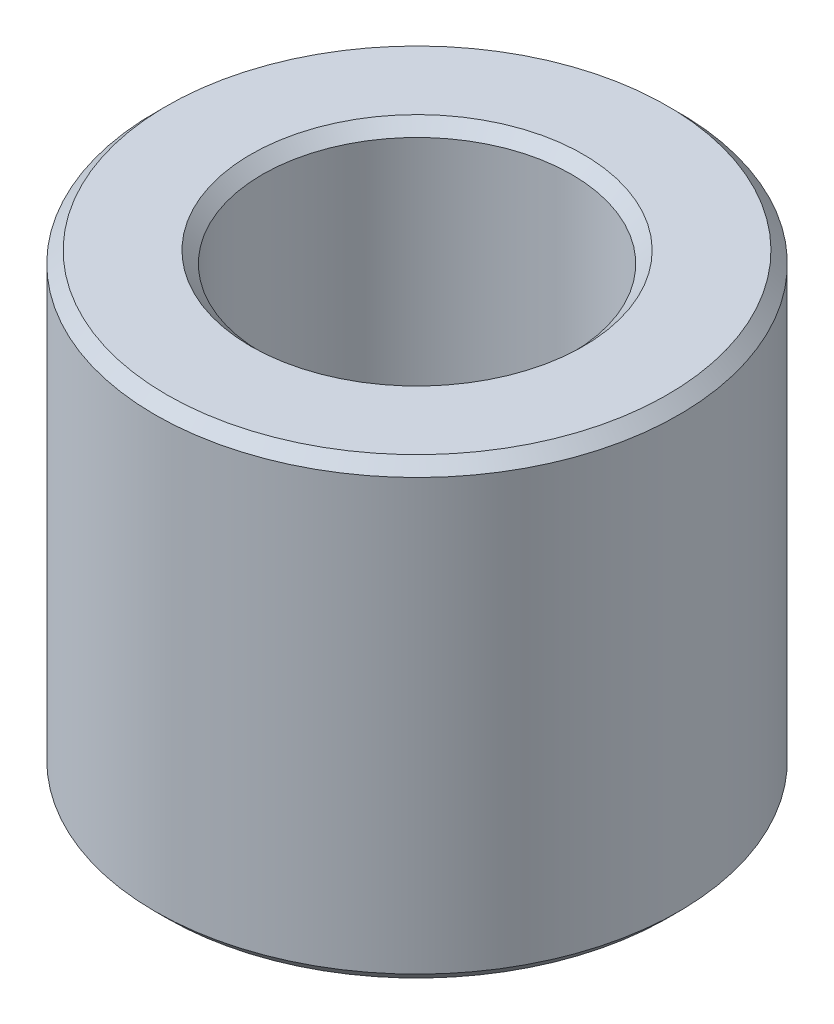
ISO-10303-21;
HEADER;
FILE_DESCRIPTION(('STEP AP214'),'2;1');
FILE_NAME('part.step','',(''),(''),'','','');
FILE_SCHEMA(('AUTOMOTIVE_DESIGN { 1 0 10303 214 1 1 1 1 }'));
ENDSEC;
DATA;
#1=APPLICATION_CONTEXT('core data for automotive mechanical design processes');
#2=APPLICATION_PROTOCOL_DEFINITION('international standard','automotive_design',2000,#1);
#3=PRODUCT_CONTEXT('',#1,'mechanical');
#4=PRODUCT('Part','Part','',(#3));
#5=PRODUCT_RELATED_PRODUCT_CATEGORY('part','',(#4));
#6=PRODUCT_DEFINITION_FORMATION('','',#4);
#7=PRODUCT_DEFINITION_CONTEXT('part definition',#1,'design');
#8=PRODUCT_DEFINITION('design','',#6,#7);
#9=PRODUCT_DEFINITION_SHAPE('','',#8);
#10=(LENGTH_UNIT() NAMED_UNIT(*) SI_UNIT(.MILLI.,.METRE.));
#11=(NAMED_UNIT(*) PLANE_ANGLE_UNIT() SI_UNIT($,.RADIAN.));
#12=(NAMED_UNIT(*) SI_UNIT($,.STERADIAN.) SOLID_ANGLE_UNIT());
#13=UNCERTAINTY_MEASURE_WITH_UNIT(LENGTH_MEASURE(1.E-05),#10,'distance_accuracy_value','');
#14=(GEOMETRIC_REPRESENTATION_CONTEXT(3) GLOBAL_UNCERTAINTY_ASSIGNED_CONTEXT((#13)) GLOBAL_UNIT_ASSIGNED_CONTEXT((#10,
#11,#12)) REPRESENTATION_CONTEXT('',''));
#15=CARTESIAN_POINT('',(0.,0.,0.));
#16=DIRECTION('',(0.,0.,1.));
#17=DIRECTION('',(1.,0.,0.));
#18=AXIS2_PLACEMENT_3D('',#15,#16,#17);
#19=CARTESIAN_POINT('',(0.,56.2595260498912,0.));
#20=DIRECTION('',(0.,-1.,0.));
#21=DIRECTION('',(0.,0.,-1.));
#22=AXIS2_PLACEMENT_3D('',#19,#20,#21);
#23=CYLINDRICAL_SURFACE('',#22,32.5);
#24=CARTESIAN_POINT('',(0.,1.43956234466632,0.));
#25=DIRECTION('',(0.,1.,0.));
#26=DIRECTION('',(0.,0.,1.));
#27=AXIS2_PLACEMENT_3D('',#24,#25,#26);
#28=CIRCLE('',#27,32.5);
#29=CARTESIAN_POINT('',(0.,1.43956234466632,32.5));
#30=VERTEX_POINT('',#29);
#31=EDGE_CURVE('E10',#30,#30,#28,.T.);
#32=ORIENTED_EDGE('',*,*,#31,.T.);
#33=EDGE_LOOP('',(#32));
#34=FACE_BOUND('',#33,.T.);
#35=CARTESIAN_POINT('',(0.,54.8199637052249,0.));
#36=DIRECTION('',(0.,1.,0.));
#37=DIRECTION('',(0.,0.,1.));
#38=AXIS2_PLACEMENT_3D('',#35,#36,#37);
#39=CIRCLE('',#38,32.5);
#40=CARTESIAN_POINT('',(0.,54.8199637052249,32.5));
#41=VERTEX_POINT('',#40);
#42=EDGE_CURVE('E50',#41,#41,#39,.F.);
#43=ORIENTED_EDGE('',*,*,#42,.T.);
#44=EDGE_LOOP('',(#43));
#45=FACE_BOUND('',#44,.T.);
#46=ADVANCED_FACE('F39',(#34,#45),#23,.T.);
#47=CARTESIAN_POINT('',(0.,56.2595260498912,0.));
#48=DIRECTION('',(0.,1.,0.));
#49=DIRECTION('',(0.,0.,1.));
#50=AXIS2_PLACEMENT_3D('',#47,#48,#49);
#51=PLANE('',#50);
#52=CARTESIAN_POINT('',(0.,56.2595260498912,0.));
#53=DIRECTION('',(0.,1.,0.));
#54=DIRECTION('',(0.,0.,1.));
#55=AXIS2_PLACEMENT_3D('',#52,#53,#54);
#56=CIRCLE('',#55,20.6347470521477);
#57=CARTESIAN_POINT('',(0.,56.2595260498912,20.6347470521477));
#58=VERTEX_POINT('',#57);
#59=EDGE_CURVE('E58',#58,#58,#56,.F.);
#60=ORIENTED_EDGE('',*,*,#59,.T.);
#61=EDGE_LOOP('',(#60));
#62=FACE_BOUND('',#61,.T.);
#63=CARTESIAN_POINT('',(0.,56.2595260498912,0.));
#64=DIRECTION('',(0.,1.,0.));
#65=DIRECTION('',(0.,0.,1.));
#66=AXIS2_PLACEMENT_3D('',#63,#64,#65);
#67=CIRCLE('',#66,31.0604376553336);
#68=CARTESIAN_POINT('',(0.,56.2595260498912,31.0604376553336));
#69=VERTEX_POINT('',#68);
#70=EDGE_CURVE('E61',#69,#69,#67,.T.);
#71=ORIENTED_EDGE('',*,*,#70,.T.);
#72=EDGE_LOOP('',(#71));
#73=FACE_BOUND('',#72,.T.);
#74=ADVANCED_FACE('F88',(#62,#73),#51,.T.);
#75=CARTESIAN_POINT('',(0.,0.,0.));
#76=DIRECTION('',(0.,1.,0.));
#77=DIRECTION('',(0.,0.,1.));
#78=AXIS2_PLACEMENT_3D('',#75,#76,#77);
#79=PLANE('',#78);
#80=CARTESIAN_POINT('',(0.,0.,0.));
#81=DIRECTION('',(0.,1.,0.));
#82=DIRECTION('',(0.,0.,1.));
#83=AXIS2_PLACEMENT_3D('',#80,#81,#82);
#84=CIRCLE('',#83,20.6347470521477);
#85=CARTESIAN_POINT('',(0.,0.,-20.6347470521477));
#86=VERTEX_POINT('',#85);
#87=EDGE_CURVE('E51',#86,#86,#84,.T.);
#88=ORIENTED_EDGE('',*,*,#87,.T.);
#89=EDGE_LOOP('',(#88));
#90=FACE_BOUND('',#89,.T.);
#91=CARTESIAN_POINT('',(0.,0.,0.));
#92=DIRECTION('',(0.,1.,0.));
#93=DIRECTION('',(0.,0.,1.));
#94=AXIS2_PLACEMENT_3D('',#91,#92,#93);
#95=CIRCLE('',#94,31.0604376553337);
#96=CARTESIAN_POINT('',(0.,0.,31.0604376553337));
#97=VERTEX_POINT('',#96);
#98=EDGE_CURVE('E54',#97,#97,#95,.F.);
#99=ORIENTED_EDGE('',*,*,#98,.T.);
#100=EDGE_LOOP('',(#99));
#101=FACE_BOUND('',#100,.T.);
#102=ADVANCED_FACE('F83',(#90,#101),#79,.F.);
#103=CARTESIAN_POINT('',(0.,56.2595260498912,0.));
#104=DIRECTION('',(0.,-1.,0.));
#105=DIRECTION('',(0.,0.,-1.));
#106=AXIS2_PLACEMENT_3D('',#103,#104,#105);
#107=CYLINDRICAL_SURFACE('',#106,19.1951847074814);
#108=CARTESIAN_POINT('',(0.,54.8199637052249,0.));
#109=DIRECTION('',(0.,1.,0.));
#110=DIRECTION('',(0.,0.,1.));
#111=AXIS2_PLACEMENT_3D('',#108,#109,#110);
#112=CIRCLE('',#111,19.1951847074814);
#113=CARTESIAN_POINT('',(0.,54.8199637052249,-19.1951847074814));
#114=VERTEX_POINT('',#113);
#115=EDGE_CURVE('E67',#114,#114,#112,.T.);
#116=CARTESIAN_POINT('',(0.,1.43956234466635,0.));
#117=DIRECTION('',(0.,1.,0.));
#118=DIRECTION('',(0.,0.,1.));
#119=AXIS2_PLACEMENT_3D('',#116,#117,#118);
#120=CIRCLE('',#119,19.1951847074814);
#121=CARTESIAN_POINT('',(0.,1.43956234466634,-19.1951847074814));
#122=VERTEX_POINT('',#121);
#123=EDGE_CURVE('E69',#122,#122,#120,.F.);
#124=CARTESIAN_POINT('',(0.,54.8199637052249,-19.1951847074814));
#125=CARTESIAN_POINT('',(0.,54.2639178577191,-19.1951847074814));
#126=CARTESIAN_POINT('',(0.,53.7078720102133,-19.1951847074814));
#127=CARTESIAN_POINT('',(0.,52.5957803152016,-19.1951847074814));
#128=CARTESIAN_POINT('',(0.,52.0397344676958,-19.1951847074814));
#129=CARTESIAN_POINT('',(0.,50.9276427726842,-19.1951847074814));
#130=CARTESIAN_POINT('',(0.,50.3715969251784,-19.1951847074814));
#131=CARTESIAN_POINT('',(0.,49.2595052301667,-19.1951847074814));
#132=CARTESIAN_POINT('',(0.,48.7034593826609,-19.1951847074814));
#133=CARTESIAN_POINT('',(0.,47.5913676876493,-19.1951847074814));
#134=CARTESIAN_POINT('',(0.,47.0353218401435,-19.1951847074814));
#135=CARTESIAN_POINT('',(0.,45.9232301451318,-19.1951847074814));
#136=CARTESIAN_POINT('',(0.,45.367184297626,-19.1951847074814));
#137=CARTESIAN_POINT('',(0.,44.2550926026144,-19.1951847074814));
#138=CARTESIAN_POINT('',(0.,43.6990467551085,-19.1951847074814));
#139=CARTESIAN_POINT('',(0.,42.5869550600969,-19.1951847074814));
#140=CARTESIAN_POINT('',(0.,42.0309092125911,-19.1951847074814));
#141=CARTESIAN_POINT('',(0.,40.9188175175794,-19.1951847074814));
#142=CARTESIAN_POINT('',(0.,40.3627716700736,-19.1951847074814));
#143=CARTESIAN_POINT('',(0.,39.250679975062,-19.1951847074814));
#144=CARTESIAN_POINT('',(0.,38.6946341275562,-19.1951847074814));
#145=CARTESIAN_POINT('',(0.,37.5825424325445,-19.1951847074814));
#146=CARTESIAN_POINT('',(0.,37.0264965850387,-19.1951847074814));
#147=CARTESIAN_POINT('',(0.,35.9144048900271,-19.1951847074814));
#148=CARTESIAN_POINT('',(0.,35.3583590425213,-19.1951847074814));
#149=CARTESIAN_POINT('',(0.,34.2462673475096,-19.1951847074814));
#150=CARTESIAN_POINT('',(0.,33.6902215000038,-19.1951847074814));
#151=CARTESIAN_POINT('',(0.,32.5781298049922,-19.1951847074814));
#152=CARTESIAN_POINT('',(0.,32.0220839574864,-19.1951847074814));
#153=CARTESIAN_POINT('',(0.,30.9099922624747,-19.1951847074814));
#154=CARTESIAN_POINT('',(0.,30.3539464149689,-19.1951847074814));
#155=CARTESIAN_POINT('',(0.,29.2418547199573,-19.1951847074814));
#156=CARTESIAN_POINT('',(0.,28.6858088724514,-19.1951847074814));
#157=CARTESIAN_POINT('',(0.,27.5737171774398,-19.1951847074814));
#158=CARTESIAN_POINT('',(0.,27.017671329934,-19.1951847074814));
#159=CARTESIAN_POINT('',(0.,25.9055796349224,-19.1951847074814));
#160=CARTESIAN_POINT('',(0.,25.3495337874165,-19.1951847074814));
#161=CARTESIAN_POINT('',(0.,24.2374420924049,-19.1951847074814));
#162=CARTESIAN_POINT('',(0.,23.6813962448991,-19.1951847074814));
#163=CARTESIAN_POINT('',(0.,22.5693045498874,-19.1951847074814));
#164=CARTESIAN_POINT('',(0.,22.0132587023816,-19.1951847074814));
#165=CARTESIAN_POINT('',(0.,20.90116700737,-19.1951847074814));
#166=CARTESIAN_POINT('',(0.,20.3451211598642,-19.1951847074814));
#167=CARTESIAN_POINT('',(0.,19.2330294648525,-19.1951847074814));
#168=CARTESIAN_POINT('',(0.,18.6769836173467,-19.1951847074814));
#169=CARTESIAN_POINT('',(0.,17.5648919223351,-19.1951847074814));
#170=CARTESIAN_POINT('',(0.,17.0088460748293,-19.1951847074814));
#171=CARTESIAN_POINT('',(0.,15.8967543798176,-19.1951847074814));
#172=CARTESIAN_POINT('',(0.,15.3407085323118,-19.1951847074814));
#173=CARTESIAN_POINT('',(0.,14.2286168373002,-19.1951847074814));
#174=CARTESIAN_POINT('',(0.,13.6725709897943,-19.1951847074814));
#175=CARTESIAN_POINT('',(0.,12.5604792947827,-19.1951847074814));
#176=CARTESIAN_POINT('',(0.,12.0044334472769,-19.1951847074814));
#177=CARTESIAN_POINT('',(0.,10.8923417522653,-19.1951847074814));
#178=CARTESIAN_POINT('',(0.,10.3362959047594,-19.1951847074814));
#179=CARTESIAN_POINT('',(0.,9.2242042097478,-19.1951847074814));
#180=CARTESIAN_POINT('',(0.,8.66815836224198,-19.1951847074814));
#181=CARTESIAN_POINT('',(0.,7.55606666723035,-19.1951847074814));
#182=CARTESIAN_POINT('',(0.,7.00002081972453,-19.1951847074814));
#183=CARTESIAN_POINT('',(0.,5.88792912471289,-19.1951847074814));
#184=CARTESIAN_POINT('',(0.,5.33188327720707,-19.1951847074814));
#185=CARTESIAN_POINT('',(0.,4.21979158219544,-19.1951847074814));
#186=CARTESIAN_POINT('',(0.,3.66374573468962,-19.1951847074814));
#187=CARTESIAN_POINT('',(0.,2.55165403967798,-19.1951847074814));
#188=CARTESIAN_POINT('',(0.,1.99560819217216,-19.1951847074814));
#189=CARTESIAN_POINT('',(0.,1.43956234466634,-19.1951847074814));
#190=B_SPLINE_CURVE_WITH_KNOTS('',3,(#124,#125,#126,#127,#128,#129,#130,#131,#132,#133,#134,
#135,#136,#137,#138,#139,#140,#141,#142,#143,#144,#145,#146,#147,#148,#149,#150,#151,#152,#153,
#154,#155,#156,#157,#158,#159,#160,#161,#162,#163,#164,#165,#166,#167,#168,#169,#170,#171,#172,
#173,#174,#175,#176,#177,#178,#179,#180,#181,#182,#183,#184,#185,#186,#187,#188,#189),
.UNSPECIFIED.,.F.,.F.,(4,2,2,2,2,2,2,2,2,2,2,2,2,2,2,2,2,2,2,2,2,2,2,2,2,2,2,2,2,2,2,2,4),(0.,
1.66813754251745,3.33627508503491,5.00441262755236,6.67255017006982,8.34068771258727,
10.0088252551047,11.6769627976222,13.3451003401396,15.0132378826571,16.6813754251745,
18.349512967692,20.0176505102095,21.6857880527269,23.3539255952444,25.0220631377618,
26.6902006802793,28.3583382227967,30.0264757653142,31.6946133078316,33.3627508503491,
35.0308883928666,36.699025935384,38.3671634779015,40.0353010204189,41.7034385629364,
43.3715761054538,45.0397136479713,46.7078511904887,48.3759887330062,50.0441262755237,
51.7122638180411,53.3804013605586),.UNSPECIFIED.);
#191=EDGE_CURVE('BSEAM71',#114,#122,#190,.T.);
#192=ORIENTED_EDGE('',*,*,#115,.T.);
#193=ORIENTED_EDGE('',*,*,#123,.T.);
#194=ORIENTED_EDGE('',*,*,#191,.T.);
#195=ORIENTED_EDGE('',*,*,#191,.F.);
#196=EDGE_LOOP('',(#192,#194,#193,#195));
#197=FACE_BOUND('',#196,.T.);
#198=ADVANCED_FACE('F71',(#197),#107,.F.);
#199=CARTESIAN_POINT('',(0.,54.8199637052249,0.));
#200=DIRECTION('',(0.,1.,0.));
#201=DIRECTION('',(0.,0.,1.));
#202=AXIS2_PLACEMENT_3D('',#199,#200,#201);
#203=CONICAL_SURFACE('',#202,19.1951847074814,0.785398163397454);
#204=ORIENTED_EDGE('',*,*,#59,.F.);
#205=EDGE_LOOP('',(#204));
#206=FACE_BOUND('',#205,.T.);
#207=ORIENTED_EDGE('',*,*,#115,.F.);
#208=EDGE_LOOP('',(#207));
#209=FACE_BOUND('',#208,.T.);
#210=ADVANCED_FACE('F77',(#206,#209),#203,.F.);
#211=CARTESIAN_POINT('',(0.,0.,0.));
#212=DIRECTION('',(0.,-1.,0.));
#213=DIRECTION('',(0.,0.,-1.));
#214=AXIS2_PLACEMENT_3D('',#211,#212,#213);
#215=CONICAL_SURFACE('',#214,20.6347470521477,0.785398163397447);
#216=CARTESIAN_POINT('',(0.,1.43956234466635,-19.1951847074814));
#217=CARTESIAN_POINT('',(0.,1.42456690357607,-19.2101801485716));
#218=CARTESIAN_POINT('',(0.,1.4095714624858,-19.2251755896619));
#219=CARTESIAN_POINT('',(0.,1.37958058030525,-19.2551664718425));
#220=CARTESIAN_POINT('',(0.,1.36458513921498,-19.2701619129327));
#221=CARTESIAN_POINT('',(0.,1.33459425703443,-19.3001527951133));
#222=CARTESIAN_POINT('',(0.,1.31959881594415,-19.3151482362036));
#223=CARTESIAN_POINT('',(0.,1.2896079337636,-19.3451391183841));
#224=CARTESIAN_POINT('',(0.,1.27461249267333,-19.3601345594744));
#225=CARTESIAN_POINT('',(0.,1.24462161049278,-19.3901254416549));
#226=CARTESIAN_POINT('',(0.,1.22962616940251,-19.4051208827452));
#227=CARTESIAN_POINT('',(0.,1.19963528722196,-19.4351117649258));
#228=CARTESIAN_POINT('',(0.,1.18463984613168,-19.450107206016));
#229=CARTESIAN_POINT('',(0.,1.15464896395113,-19.4800980881966));
#230=CARTESIAN_POINT('',(0.,1.13965352286086,-19.4950935292868));
#231=CARTESIAN_POINT('',(0.,1.10966264068031,-19.5250844114674));
#232=CARTESIAN_POINT('',(0.,1.09466719959004,-19.5400798525577));
#233=CARTESIAN_POINT('',(0.,1.06467631740949,-19.5700707347382));
#234=CARTESIAN_POINT('',(0.,1.04968087631921,-19.5850661758285));
#235=CARTESIAN_POINT('',(0.,1.01968999413866,-19.615057058009));
#236=CARTESIAN_POINT('',(0.,1.00469455304839,-19.6300524990993));
#237=CARTESIAN_POINT('',(0.,0.974703670867841,-19.6600433812799));
#238=CARTESIAN_POINT('',(0.,0.959708229777566,-19.6750388223701));
#239=CARTESIAN_POINT('',(0.,0.929717347597017,-19.7050297045507));
#240=CARTESIAN_POINT('',(0.,0.914721906506743,-19.720025145641));
#241=CARTESIAN_POINT('',(0.,0.884731024326194,-19.7500160278215));
#242=CARTESIAN_POINT('',(0.,0.869735583235919,-19.7650114689118));
#243=CARTESIAN_POINT('',(0.,0.83974470105537,-19.7950023510923));
#244=CARTESIAN_POINT('',(0.,0.824749259965096,-19.8099977921826));
#245=CARTESIAN_POINT('',(0.,0.794758377784547,-19.8399886743632));
#246=CARTESIAN_POINT('',(0.,0.779762936694273,-19.8549841154534));
#247=CARTESIAN_POINT('',(0.,0.749772054513724,-19.884974997634));
#248=CARTESIAN_POINT('',(0.,0.734776613423449,-19.8999704387243));
#249=CARTESIAN_POINT('',(0.,0.7047857312429,-19.9299613209048));
#250=CARTESIAN_POINT('',(0.,0.689790290152626,-19.9449567619951));
#251=CARTESIAN_POINT('',(0.,0.659799407972077,-19.9749476441756));
#252=CARTESIAN_POINT('',(0.,0.644803966881802,-19.9899430852659));
#253=CARTESIAN_POINT('',(0.,0.614813084701253,-20.0199339674465));
#254=CARTESIAN_POINT('',(0.,0.599817643610979,-20.0349294085367));
#255=CARTESIAN_POINT('',(0.,0.56982676143043,-20.0649202907173));
#256=CARTESIAN_POINT('',(0.,0.554831320340155,-20.0799157318075));
#257=CARTESIAN_POINT('',(0.,0.524840438159606,-20.1099066139881));
#258=CARTESIAN_POINT('',(0.,0.509844997069332,-20.1249020550784));
#259=CARTESIAN_POINT('',(0.,0.479854114888783,-20.1548929372589));
#260=CARTESIAN_POINT('',(0.,0.464858673798509,-20.1698883783492));
#261=CARTESIAN_POINT('',(0.,0.43486779161796,-20.1998792605297));
#262=CARTESIAN_POINT('',(0.,0.419872350527685,-20.21487470162));
#263=CARTESIAN_POINT('',(0.,0.389881468347136,-20.2448655838006));
#264=CARTESIAN_POINT('',(0.,0.374886027256862,-20.2598610248908));
#265=CARTESIAN_POINT('',(0.,0.344895145076313,-20.2898519070714));
#266=CARTESIAN_POINT('',(0.,0.329899703986038,-20.3048473481617));
#267=CARTESIAN_POINT('',(0.,0.29990882180549,-20.3348382303422));
#268=CARTESIAN_POINT('',(0.,0.284913380715215,-20.3498336714325));
#269=CARTESIAN_POINT('',(0.,0.254922498534666,-20.379824553613));
#270=CARTESIAN_POINT('',(0.,0.239927057444391,-20.3948199947033));
#271=CARTESIAN_POINT('',(0.,0.209936175263842,-20.4248108768839));
#272=CARTESIAN_POINT('',(0.,0.194940734173568,-20.4398063179741));
#273=CARTESIAN_POINT('',(0.,0.164949851993019,-20.4697972001547));
#274=CARTESIAN_POINT('',(0.,0.149954410902745,-20.484792641245));
#275=CARTESIAN_POINT('',(0.,0.119963528722196,-20.5147835234255));
#276=CARTESIAN_POINT('',(0.,0.104968087631921,-20.5297789645158));
#277=CARTESIAN_POINT('',(0.,0.0749772054513724,-20.5597698466963));
#278=CARTESIAN_POINT('',(0.,0.0599817643610979,-20.5747652877866));
#279=CARTESIAN_POINT('',(0.,0.0299908821805489,-20.6047561699672));
#280=CARTESIAN_POINT('',(0.,0.0149954410902745,-20.6197516110574));
#281=CARTESIAN_POINT('',(0.,0.,-20.6347470521477));
#282=B_SPLINE_CURVE_WITH_KNOTS('',3,(#216,#217,#218,#219,#220,#221,#222,#223,#224,#225,#226,
#227,#228,#229,#230,#231,#232,#233,#234,#235,#236,#237,#238,#239,#240,#241,#242,#243,#244,#245,
#246,#247,#248,#249,#250,#251,#252,#253,#254,#255,#256,#257,#258,#259,#260,#261,#262,#263,#264,
#265,#266,#267,#268,#269,#270,#271,#272,#273,#274,#275,#276,#277,#278,#279,#280,#281),
.UNSPECIFIED.,.F.,.F.,(4,2,2,2,2,2,2,2,2,2,2,2,2,2,2,2,2,2,2,2,2,2,2,2,2,2,2,2,2,2,2,2,4),(0.,
0.063620268490899,0.127240536981798,0.190860805472697,0.254481073963596,0.318101342454493,
0.381721610945392,0.445341879436291,0.50896214792719,0.572582416418089,0.636202684908988,
0.699822953399887,0.763443221890786,0.827063490381685,0.890683758872584,0.954304027363483,
1.01792429585438,1.08154456434528,1.14516483283618,1.20878510132708,1.27240536981797,
1.33602563830887,1.39964590679977,1.46326617529067,1.52688644378157,1.59050671227247,
1.65412698076337,1.71774724925426,1.78136751774516,1.84498778623606,1.90860805472696,
1.97222832321786,2.03584859170876),.UNSPECIFIED.);
#283=EDGE_CURVE('BSEAM73',#122,#86,#282,.T.);
#284=ORIENTED_EDGE('',*,*,#123,.F.);
#285=ORIENTED_EDGE('',*,*,#87,.F.);
#286=ORIENTED_EDGE('',*,*,#283,.T.);
#287=ORIENTED_EDGE('',*,*,#283,.F.);
#288=EDGE_LOOP('',(#284,#286,#285,#287));
#289=FACE_BOUND('',#288,.T.);
#290=ADVANCED_FACE('F73',(#289),#215,.F.);
#291=CARTESIAN_POINT('',(0.,1.43956234466632,0.));
#292=DIRECTION('',(0.,1.,0.));
#293=DIRECTION('',(0.,0.,1.));
#294=AXIS2_PLACEMENT_3D('',#291,#292,#293);
#295=CONICAL_SURFACE('',#294,32.5,0.785398163397453);
#296=ORIENTED_EDGE('',*,*,#98,.F.);
#297=EDGE_LOOP('',(#296));
#298=FACE_BOUND('',#297,.T.);
#299=ORIENTED_EDGE('',*,*,#31,.F.);
#300=EDGE_LOOP('',(#299));
#301=FACE_BOUND('',#300,.T.);
#302=ADVANCED_FACE('F76',(#298,#301),#295,.T.);
#303=CARTESIAN_POINT('',(0.,56.2595260498912,0.));
#304=DIRECTION('',(0.,-1.,0.));
#305=DIRECTION('',(0.,0.,-1.));
#306=AXIS2_PLACEMENT_3D('',#303,#304,#305);
#307=CONICAL_SURFACE('',#306,31.0604376553336,0.785398163397453);
#308=ORIENTED_EDGE('',*,*,#42,.F.);
#309=EDGE_LOOP('',(#308));
#310=FACE_BOUND('',#309,.T.);
#311=ORIENTED_EDGE('',*,*,#70,.F.);
#312=EDGE_LOOP('',(#311));
#313=FACE_BOUND('',#312,.T.);
#314=ADVANCED_FACE('F45',(#310,#313),#307,.T.);
#315=CLOSED_SHELL('',(#46,#74,#102,#198,#210,#290,#302,#314));
#316=MANIFOLD_SOLID_BREP('B2',#315);
#317=ADVANCED_BREP_SHAPE_REPRESENTATION('',(#18,#316),#14);
#318=SHAPE_DEFINITION_REPRESENTATION(#9,#317);
ENDSEC;
END-ISO-10303-21;
